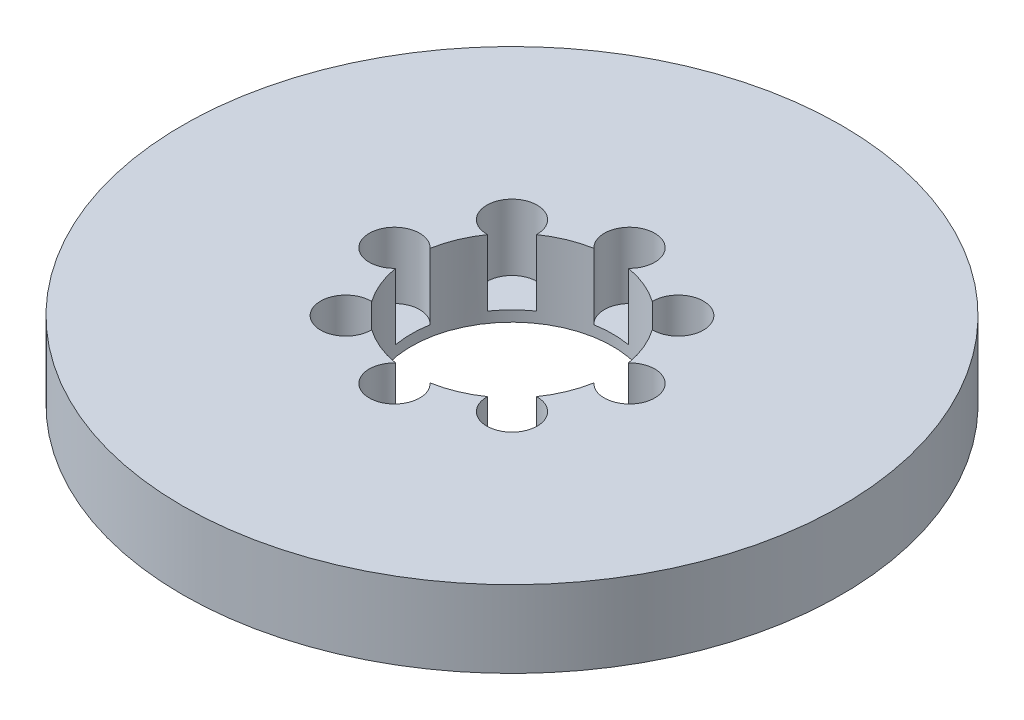
ISO-10303-21;
HEADER;
FILE_DESCRIPTION(('STEP AP214'),'2;1');
FILE_NAME('part.step','',(''),(''),'','','');
FILE_SCHEMA(('AUTOMOTIVE_DESIGN { 1 0 10303 214 1 1 1 1 }'));
ENDSEC;
DATA;
#1=APPLICATION_CONTEXT('core data for automotive mechanical design processes');
#2=APPLICATION_PROTOCOL_DEFINITION('international standard','automotive_design',2000,#1);
#3=PRODUCT_CONTEXT('',#1,'mechanical');
#4=PRODUCT('Part','Part','',(#3));
#5=PRODUCT_RELATED_PRODUCT_CATEGORY('part','',(#4));
#6=PRODUCT_DEFINITION_FORMATION('','',#4);
#7=PRODUCT_DEFINITION_CONTEXT('part definition',#1,'design');
#8=PRODUCT_DEFINITION('design','',#6,#7);
#9=PRODUCT_DEFINITION_SHAPE('','',#8);
#10=(LENGTH_UNIT() NAMED_UNIT(*) SI_UNIT(.MILLI.,.METRE.));
#11=(NAMED_UNIT(*) PLANE_ANGLE_UNIT() SI_UNIT($,.RADIAN.));
#12=(NAMED_UNIT(*) SI_UNIT($,.STERADIAN.) SOLID_ANGLE_UNIT());
#13=UNCERTAINTY_MEASURE_WITH_UNIT(LENGTH_MEASURE(1.E-05),#10,'distance_accuracy_value','');
#14=(GEOMETRIC_REPRESENTATION_CONTEXT(3) GLOBAL_UNCERTAINTY_ASSIGNED_CONTEXT((#13)) GLOBAL_UNIT_ASSIGNED_CONTEXT((#10,
#11,#12)) REPRESENTATION_CONTEXT('',''));
#15=CARTESIAN_POINT('',(0.,0.,0.));
#16=DIRECTION('',(0.,0.,1.));
#17=DIRECTION('',(1.,0.,0.));
#18=AXIS2_PLACEMENT_3D('',#15,#16,#17);
#19=CARTESIAN_POINT('',(0.,21.,0.));
#20=DIRECTION('',(0.,-1.,0.));
#21=DIRECTION('',(0.,0.,-1.));
#22=AXIS2_PLACEMENT_3D('',#19,#20,#21);
#23=CYLINDRICAL_SURFACE('',#22,90.);
#24=CARTESIAN_POINT('',(0.,21.,0.));
#25=DIRECTION('',(0.,1.,0.));
#26=DIRECTION('',(0.,0.,1.));
#27=AXIS2_PLACEMENT_3D('',#24,#25,#26);
#28=CIRCLE('',#27,90.);
#29=CARTESIAN_POINT('',(0.,21.,-90.));
#30=VERTEX_POINT('',#29);
#31=EDGE_CURVE('E195',#30,#30,#28,.T.);
#32=CARTESIAN_POINT('',(0.,0.,0.));
#33=DIRECTION('',(0.,1.,0.));
#34=DIRECTION('',(0.,0.,1.));
#35=AXIS2_PLACEMENT_3D('',#32,#33,#34);
#36=CIRCLE('',#35,90.);
#37=CARTESIAN_POINT('',(0.,0.,-90.));
#38=VERTEX_POINT('',#37);
#39=EDGE_CURVE('E179',#38,#38,#36,.T.);
#40=CARTESIAN_POINT('',(0.,21.,-90.));
#41=CARTESIAN_POINT('',(0.,20.78125,-90.));
#42=CARTESIAN_POINT('',(0.,20.5625,-90.));
#43=CARTESIAN_POINT('',(0.,20.125,-90.));
#44=CARTESIAN_POINT('',(0.,19.90625,-90.));
#45=CARTESIAN_POINT('',(0.,19.46875,-90.));
#46=CARTESIAN_POINT('',(0.,19.25,-90.));
#47=CARTESIAN_POINT('',(0.,18.8125,-90.));
#48=CARTESIAN_POINT('',(0.,18.59375,-90.));
#49=CARTESIAN_POINT('',(0.,18.15625,-90.));
#50=CARTESIAN_POINT('',(0.,17.9375,-90.));
#51=CARTESIAN_POINT('',(0.,17.5,-90.));
#52=CARTESIAN_POINT('',(0.,17.28125,-90.));
#53=CARTESIAN_POINT('',(0.,16.84375,-90.));
#54=CARTESIAN_POINT('',(0.,16.625,-90.));
#55=CARTESIAN_POINT('',(0.,16.1875,-90.));
#56=CARTESIAN_POINT('',(0.,15.96875,-90.));
#57=CARTESIAN_POINT('',(0.,15.53125,-90.));
#58=CARTESIAN_POINT('',(0.,15.3125,-90.));
#59=CARTESIAN_POINT('',(0.,14.875,-90.));
#60=CARTESIAN_POINT('',(0.,14.65625,-90.));
#61=CARTESIAN_POINT('',(0.,14.21875,-90.));
#62=CARTESIAN_POINT('',(0.,14.,-90.));
#63=CARTESIAN_POINT('',(0.,13.5625,-90.));
#64=CARTESIAN_POINT('',(0.,13.34375,-90.));
#65=CARTESIAN_POINT('',(0.,12.90625,-90.));
#66=CARTESIAN_POINT('',(0.,12.6875,-90.));
#67=CARTESIAN_POINT('',(0.,12.25,-90.));
#68=CARTESIAN_POINT('',(0.,12.03125,-90.));
#69=CARTESIAN_POINT('',(0.,11.59375,-90.));
#70=CARTESIAN_POINT('',(0.,11.375,-90.));
#71=CARTESIAN_POINT('',(0.,10.9375,-90.));
#72=CARTESIAN_POINT('',(0.,10.71875,-90.));
#73=CARTESIAN_POINT('',(0.,10.28125,-90.));
#74=CARTESIAN_POINT('',(0.,10.0625,-90.));
#75=CARTESIAN_POINT('',(0.,9.625,-90.));
#76=CARTESIAN_POINT('',(0.,9.40625,-90.));
#77=CARTESIAN_POINT('',(0.,8.96875,-90.));
#78=CARTESIAN_POINT('',(0.,8.75,-90.));
#79=CARTESIAN_POINT('',(0.,8.3125,-90.));
#80=CARTESIAN_POINT('',(0.,8.09375,-90.));
#81=CARTESIAN_POINT('',(0.,7.65625,-90.));
#82=CARTESIAN_POINT('',(0.,7.4375,-90.));
#83=CARTESIAN_POINT('',(0.,7.,-90.));
#84=CARTESIAN_POINT('',(0.,6.78125,-90.));
#85=CARTESIAN_POINT('',(0.,6.34375,-90.));
#86=CARTESIAN_POINT('',(0.,6.125,-90.));
#87=CARTESIAN_POINT('',(0.,5.6875,-90.));
#88=CARTESIAN_POINT('',(0.,5.46875,-90.));
#89=CARTESIAN_POINT('',(0.,5.03125,-90.));
#90=CARTESIAN_POINT('',(0.,4.8125,-90.));
#91=CARTESIAN_POINT('',(0.,4.375,-90.));
#92=CARTESIAN_POINT('',(0.,4.15625,-90.));
#93=CARTESIAN_POINT('',(0.,3.71875,-90.));
#94=CARTESIAN_POINT('',(0.,3.5,-90.));
#95=CARTESIAN_POINT('',(0.,3.0625,-90.));
#96=CARTESIAN_POINT('',(0.,2.84375,-90.));
#97=CARTESIAN_POINT('',(0.,2.40625,-90.));
#98=CARTESIAN_POINT('',(0.,2.1875,-90.));
#99=CARTESIAN_POINT('',(0.,1.75,-90.));
#100=CARTESIAN_POINT('',(0.,1.53125,-90.));
#101=CARTESIAN_POINT('',(0.,1.09375,-90.));
#102=CARTESIAN_POINT('',(0.,0.875000000000001,-90.));
#103=CARTESIAN_POINT('',(0.,0.4375,-90.));
#104=CARTESIAN_POINT('',(0.,0.21875,-90.));
#105=CARTESIAN_POINT('',(0.,0.,-90.));
#106=B_SPLINE_CURVE_WITH_KNOTS('',3,(#40,#41,#42,#43,#44,#45,#46,#47,#48,#49,#50,#51,#52,#53,
#54,#55,#56,#57,#58,#59,#60,#61,#62,#63,#64,#65,#66,#67,#68,#69,#70,#71,#72,#73,#74,#75,#76,#77,
#78,#79,#80,#81,#82,#83,#84,#85,#86,#87,#88,#89,#90,#91,#92,#93,#94,#95,#96,#97,#98,#99,#100,
#101,#102,#103,#104,#105),.UNSPECIFIED.,.F.,.F.,(4,2,2,2,2,2,2,2,2,2,2,2,2,2,2,2,2,2,2,2,2,2,2,
2,2,2,2,2,2,2,2,2,4),(0.,0.656250000000001,1.3125,1.96875,2.625,3.28125,3.9375,4.59375,5.25,
5.90625,6.5625,7.21875,7.875,8.53125,9.1875,9.84375,10.5,11.15625,11.8125,12.46875,13.125,
13.78125,14.4375,15.09375,15.75,16.40625,17.0625,17.71875,18.375,19.03125,19.6875,20.34375,21.),.UNSPECIFIED.);
#107=EDGE_CURVE('BSEAM39',#30,#38,#106,.T.);
#108=ORIENTED_EDGE('',*,*,#31,.F.);
#109=ORIENTED_EDGE('',*,*,#39,.T.);
#110=ORIENTED_EDGE('',*,*,#107,.T.);
#111=ORIENTED_EDGE('',*,*,#107,.F.);
#112=EDGE_LOOP('',(#108,#110,#109,#111));
#113=FACE_BOUND('',#112,.T.);
#114=ADVANCED_FACE('F39',(#113),#23,.T.);
#115=CARTESIAN_POINT('',(0.,21.,0.));
#116=DIRECTION('',(0.,1.,0.));
#117=DIRECTION('',(0.,0.,1.));
#118=AXIS2_PLACEMENT_3D('',#115,#116,#117);
#119=PLANE('',#118);
#120=CARTESIAN_POINT('',(1.12057791049175E-13,21.,32.0946269431598));
#121=DIRECTION('',(0.,1.,0.));
#122=DIRECTION('',(1.,0.,0.));
#123=AXIS2_PLACEMENT_3D('',#120,#121,#122);
#124=CIRCLE('',#123,6.88257928102318);
#125=CARTESIAN_POINT('',(-4.72574817027754,21.,27.0909081470356));
#126=VERTEX_POINT('',#125);
#127=CARTESIAN_POINT('',(4.72574817027773,21.,27.0909081470355));
#128=VERTEX_POINT('',#127);
#129=EDGE_CURVE('E176',#126,#128,#124,.T.);
#130=ORIENTED_EDGE('',*,*,#129,.F.);
#131=CARTESIAN_POINT('',(0.,21.,0.));
#132=DIRECTION('',(0.,1.,0.));
#133=DIRECTION('',(0.,0.,1.));
#134=AXIS2_PLACEMENT_3D('',#131,#132,#133);
#135=CIRCLE('',#134,27.5);
#136=CARTESIAN_POINT('',(-15.8145562818875,21.,22.497773436654));
#137=VERTEX_POINT('',#136);
#138=EDGE_CURVE('E166',#137,#126,#135,.T.);
#139=ORIENTED_EDGE('',*,*,#138,.F.);
#140=CARTESIAN_POINT('',(-22.6943283511607,21.,22.6943283511608));
#141=DIRECTION('',(0.,1.,0.));
#142=DIRECTION('',(0.707106781186549,0.,0.707106781186546));
#143=AXIS2_PLACEMENT_3D('',#140,#141,#142);
#144=CIRCLE('',#143,6.88257928102318);
#145=CARTESIAN_POINT('',(-22.4977734366539,21.,15.8145562818875));
#146=VERTEX_POINT('',#145);
#147=EDGE_CURVE('E147',#146,#137,#144,.T.);
#148=ORIENTED_EDGE('',*,*,#147,.F.);
#149=CARTESIAN_POINT('',(-27.0909081470356,21.,4.72574817027764));
#150=VERTEX_POINT('',#149);
#151=EDGE_CURVE('E180',#150,#146,#135,.T.);
#152=ORIENTED_EDGE('',*,*,#151,.F.);
#153=CARTESIAN_POINT('',(-32.0946269431598,21.,0.));
#154=DIRECTION('',(0.,1.,0.));
#155=DIRECTION('',(0.,0.,1.));
#156=AXIS2_PLACEMENT_3D('',#153,#154,#155);
#157=CIRCLE('',#156,6.88257928102318);
#158=CARTESIAN_POINT('',(-27.0909081470356,21.,-4.72574817027764));
#159=VERTEX_POINT('',#158);
#160=EDGE_CURVE('E186',#159,#150,#157,.T.);
#161=ORIENTED_EDGE('',*,*,#160,.F.);
#162=CARTESIAN_POINT('',(-22.4977734366542,21.,-15.8145562818872));
#163=VERTEX_POINT('',#162);
#164=EDGE_CURVE('E182',#163,#159,#135,.T.);
#165=ORIENTED_EDGE('',*,*,#164,.F.);
#166=CARTESIAN_POINT('',(-22.6943283511611,21.,-22.6943283511605));
#167=DIRECTION('',(0.,1.,0.));
#168=DIRECTION('',(-0.707106781186539,0.,0.707106781186556));
#169=AXIS2_PLACEMENT_3D('',#166,#167,#168);
#170=CIRCLE('',#169,6.88257928102318);
#171=CARTESIAN_POINT('',(-15.8145562818878,21.,-22.4977734366538));
#172=VERTEX_POINT('',#171);
#173=EDGE_CURVE('E446',#172,#163,#170,.T.);
#174=ORIENTED_EDGE('',*,*,#173,.F.);
#175=CARTESIAN_POINT('',(-4.72574817027792,21.,-27.0909081470355));
#176=VERTEX_POINT('',#175);
#177=EDGE_CURVE('E452',#176,#172,#135,.T.);
#178=ORIENTED_EDGE('',*,*,#177,.F.);
#179=CARTESIAN_POINT('',(-3.36173373147524E-13,21.,-32.0946269431598));
#180=DIRECTION('',(0.,1.,0.));
#181=DIRECTION('',(-1.,0.,0.));
#182=AXIS2_PLACEMENT_3D('',#179,#180,#181);
#183=CIRCLE('',#182,6.88257928102318);
#184=CARTESIAN_POINT('',(4.72574817027735,21.,-27.0909081470356));
#185=VERTEX_POINT('',#184);
#186=EDGE_CURVE('E477',#185,#176,#183,.T.);
#187=ORIENTED_EDGE('',*,*,#186,.F.);
#188=CARTESIAN_POINT('',(15.8145562818873,21.,-22.4977734366541));
#189=VERTEX_POINT('',#188);
#190=EDGE_CURVE('E460',#189,#185,#135,.T.);
#191=ORIENTED_EDGE('',*,*,#190,.F.);
#192=CARTESIAN_POINT('',(22.6943283511606,21.,-22.694328351161));
#193=DIRECTION('',(0.,1.,0.));
#194=DIRECTION('',(-0.707106781186554,0.,-0.707106781186541));
#195=AXIS2_PLACEMENT_3D('',#192,#193,#194);
#196=CIRCLE('',#195,6.88257928102318);
#197=CARTESIAN_POINT('',(22.4977734366538,21.,-15.8145562818877));
#198=VERTEX_POINT('',#197);
#199=EDGE_CURVE('E464',#198,#189,#196,.T.);
#200=ORIENTED_EDGE('',*,*,#199,.F.);
#201=CARTESIAN_POINT('',(27.0909081470356,21.,-4.72574817027764));
#202=VERTEX_POINT('',#201);
#203=EDGE_CURVE('E459',#202,#198,#135,.T.);
#204=ORIENTED_EDGE('',*,*,#203,.F.);
#205=CARTESIAN_POINT('',(32.0946269431598,21.,0.));
#206=DIRECTION('',(0.,1.,0.));
#207=DIRECTION('',(0.,0.,-1.));
#208=AXIS2_PLACEMENT_3D('',#205,#206,#207);
#209=CIRCLE('',#208,6.88257928102318);
#210=CARTESIAN_POINT('',(27.0909081470356,21.,4.72574817027764));
#211=VERTEX_POINT('',#210);
#212=EDGE_CURVE('E469',#211,#202,#209,.T.);
#213=ORIENTED_EDGE('',*,*,#212,.F.);
#214=CARTESIAN_POINT('',(22.497773436654,21.,15.8145562818874));
#215=VERTEX_POINT('',#214);
#216=EDGE_CURVE('E181',#215,#211,#135,.T.);
#217=ORIENTED_EDGE('',*,*,#216,.F.);
#218=CARTESIAN_POINT('',(22.6943283511609,21.,22.6943283511607));
#219=DIRECTION('',(0.,1.,0.));
#220=DIRECTION('',(0.707106781186544,0.,-0.707106781186551));
#221=AXIS2_PLACEMENT_3D('',#218,#219,#220);
#222=CIRCLE('',#221,6.88257928102318);
#223=CARTESIAN_POINT('',(15.8145562818876,21.,22.4977734366539));
#224=VERTEX_POINT('',#223);
#225=EDGE_CURVE('E475',#224,#215,#222,.T.);
#226=ORIENTED_EDGE('',*,*,#225,.F.);
#227=EDGE_CURVE('E177',#128,#224,#135,.T.);
#228=ORIENTED_EDGE('',*,*,#227,.F.);
#229=EDGE_LOOP('',(#130,#139,#148,#152,#161,#165,#174,#178,#187,#191,#200,#204,#213,#217,#226,#228));
#230=FACE_BOUND('',#229,.T.);
#231=ORIENTED_EDGE('',*,*,#31,.T.);
#232=EDGE_LOOP('',(#231));
#233=FACE_BOUND('',#232,.T.);
#234=ADVANCED_FACE('F172',(#230,#233),#119,.T.);
#235=CARTESIAN_POINT('',(0.,0.,0.));
#236=DIRECTION('',(0.,1.,0.));
#237=DIRECTION('',(0.,0.,1.));
#238=AXIS2_PLACEMENT_3D('',#235,#236,#237);
#239=PLANE('',#238);
#240=CARTESIAN_POINT('',(0.,0.,0.));
#241=DIRECTION('',(0.,1.,0.));
#242=DIRECTION('',(0.,0.,1.));
#243=AXIS2_PLACEMENT_3D('',#240,#241,#242);
#244=CIRCLE('',#243,27.5);
#245=CARTESIAN_POINT('',(0.,0.,27.5));
#246=VERTEX_POINT('',#245);
#247=EDGE_CURVE('E187',#246,#246,#244,.T.);
#248=ORIENTED_EDGE('',*,*,#247,.T.);
#249=EDGE_LOOP('',(#248));
#250=FACE_BOUND('',#249,.T.);
#251=ORIENTED_EDGE('',*,*,#39,.F.);
#252=EDGE_LOOP('',(#251));
#253=FACE_BOUND('',#252,.T.);
#254=ADVANCED_FACE('F270',(#250,#253),#239,.F.);
#255=CARTESIAN_POINT('',(0.,21.,0.));
#256=DIRECTION('',(0.,-1.,0.));
#257=DIRECTION('',(0.,0.,-1.));
#258=AXIS2_PLACEMENT_3D('',#255,#256,#257);
#259=CYLINDRICAL_SURFACE('',#258,27.5);
#260=DIRECTION('',(0.,1.,0.));
#261=VECTOR('',#260,1.);
#262=CARTESIAN_POINT('',(-4.72574817027753,11.9654193824633,27.0909081470356));
#263=LINE('',#262,#261);
#264=CARTESIAN_POINT('',(-4.72574817027754,2.93083876492653,27.0909081470356));
#265=VERTEX_POINT('',#264);
#266=EDGE_CURVE('E11',#265,#126,#263,.T.);
#267=ORIENTED_EDGE('',*,*,#266,.F.);
#268=CARTESIAN_POINT('',(0.,2.93083876492653,0.));
#269=DIRECTION('',(0.,1.,0.));
#270=DIRECTION('',(0.,0.,1.));
#271=AXIS2_PLACEMENT_3D('',#268,#269,#270);
#272=CIRCLE('',#271,27.5);
#273=CARTESIAN_POINT('',(4.72574817027773,2.93083876492653,27.0909081470355));
#274=VERTEX_POINT('',#273);
#275=EDGE_CURVE('E250',#265,#274,#272,.T.);
#276=ORIENTED_EDGE('',*,*,#275,.T.);
#277=DIRECTION('',(0.,1.,0.));
#278=VECTOR('',#277,1.);
#279=CARTESIAN_POINT('',(4.72574817027772,11.9654193824633,27.0909081470355));
#280=LINE('',#279,#278);
#281=EDGE_CURVE('E46',#128,#274,#280,.F.);
#282=ORIENTED_EDGE('',*,*,#281,.F.);
#283=ORIENTED_EDGE('',*,*,#227,.T.);
#284=DIRECTION('',(0.,1.,0.));
#285=VECTOR('',#284,1.);
#286=CARTESIAN_POINT('',(15.8145562818876,11.9654193824633,22.4977734366539));
#287=LINE('',#286,#285);
#288=CARTESIAN_POINT('',(15.8145562818876,2.93083876492653,22.4977734366539));
#289=VERTEX_POINT('',#288);
#290=EDGE_CURVE('E244',#289,#224,#287,.T.);
#291=ORIENTED_EDGE('',*,*,#290,.F.);
#292=CARTESIAN_POINT('',(0.,2.93083876492653,0.));
#293=DIRECTION('',(0.,1.,0.));
#294=DIRECTION('',(0.,0.,1.));
#295=AXIS2_PLACEMENT_3D('',#292,#293,#294);
#296=CIRCLE('',#295,27.5);
#297=CARTESIAN_POINT('',(22.497773436654,2.93083876492653,15.8145562818874));
#298=VERTEX_POINT('',#297);
#299=EDGE_CURVE('E238',#289,#298,#296,.T.);
#300=ORIENTED_EDGE('',*,*,#299,.T.);
#301=DIRECTION('',(0.,1.,0.));
#302=VECTOR('',#301,1.);
#303=CARTESIAN_POINT('',(22.497773436654,11.9654193824633,15.8145562818874));
#304=LINE('',#303,#302);
#305=EDGE_CURVE('E242',#215,#298,#304,.F.);
#306=ORIENTED_EDGE('',*,*,#305,.F.);
#307=ORIENTED_EDGE('',*,*,#216,.T.);
#308=DIRECTION('',(0.,1.,0.));
#309=VECTOR('',#308,1.);
#310=CARTESIAN_POINT('',(27.0909081470355,11.9654193824633,4.72574817027763));
#311=LINE('',#310,#309);
#312=CARTESIAN_POINT('',(27.0909081470356,2.93083876492653,4.72574817027764));
#313=VERTEX_POINT('',#312);
#314=EDGE_CURVE('E236',#313,#211,#311,.T.);
#315=ORIENTED_EDGE('',*,*,#314,.F.);
#316=CARTESIAN_POINT('',(0.,2.93083876492653,0.));
#317=DIRECTION('',(0.,1.,0.));
#318=DIRECTION('',(0.,0.,1.));
#319=AXIS2_PLACEMENT_3D('',#316,#317,#318);
#320=CIRCLE('',#319,27.5);
#321=CARTESIAN_POINT('',(27.0909081470356,2.93083876492653,-4.72574817027764));
#322=VERTEX_POINT('',#321);
#323=EDGE_CURVE('E235',#313,#322,#320,.T.);
#324=ORIENTED_EDGE('',*,*,#323,.T.);
#325=DIRECTION('',(0.,1.,0.));
#326=VECTOR('',#325,1.);
#327=CARTESIAN_POINT('',(27.0909081470355,11.9654193824633,-4.72574817027763));
#328=LINE('',#327,#326);
#329=EDGE_CURVE('E234',#202,#322,#328,.F.);
#330=ORIENTED_EDGE('',*,*,#329,.F.);
#331=ORIENTED_EDGE('',*,*,#203,.T.);
#332=DIRECTION('',(0.,1.,0.));
#333=VECTOR('',#332,1.);
#334=CARTESIAN_POINT('',(22.4977734366538,11.9654193824633,-15.8145562818877));
#335=LINE('',#334,#333);
#336=CARTESIAN_POINT('',(22.4977734366538,2.93083876492653,-15.8145562818877));
#337=VERTEX_POINT('',#336);
#338=EDGE_CURVE('E229',#337,#198,#335,.T.);
#339=ORIENTED_EDGE('',*,*,#338,.F.);
#340=CARTESIAN_POINT('',(0.,2.93083876492653,0.));
#341=DIRECTION('',(0.,1.,0.));
#342=DIRECTION('',(0.,0.,1.));
#343=AXIS2_PLACEMENT_3D('',#340,#341,#342);
#344=CIRCLE('',#343,27.5);
#345=CARTESIAN_POINT('',(15.8145562818873,2.93083876492653,-22.4977734366541));
#346=VERTEX_POINT('',#345);
#347=EDGE_CURVE('E221',#337,#346,#344,.T.);
#348=ORIENTED_EDGE('',*,*,#347,.T.);
#349=DIRECTION('',(0.,1.,0.));
#350=VECTOR('',#349,1.);
#351=CARTESIAN_POINT('',(15.8145562818873,11.9654193824633,-22.4977734366541));
#352=LINE('',#351,#350);
#353=EDGE_CURVE('E230',#189,#346,#352,.F.);
#354=ORIENTED_EDGE('',*,*,#353,.F.);
#355=ORIENTED_EDGE('',*,*,#190,.T.);
#356=DIRECTION('',(0.,1.,0.));
#357=VECTOR('',#356,1.);
#358=CARTESIAN_POINT('',(4.72574817027734,11.9654193824633,-27.0909081470356));
#359=LINE('',#358,#357);
#360=CARTESIAN_POINT('',(4.72574817027735,2.93083876492653,-27.0909081470356));
#361=VERTEX_POINT('',#360);
#362=EDGE_CURVE('E225',#361,#185,#359,.T.);
#363=ORIENTED_EDGE('',*,*,#362,.F.);
#364=CARTESIAN_POINT('',(0.,2.93083876492653,0.));
#365=DIRECTION('',(0.,1.,0.));
#366=DIRECTION('',(0.,0.,1.));
#367=AXIS2_PLACEMENT_3D('',#364,#365,#366);
#368=CIRCLE('',#367,27.5);
#369=CARTESIAN_POINT('',(-4.72574817027792,2.93083876492653,-27.0909081470355));
#370=VERTEX_POINT('',#369);
#371=EDGE_CURVE('E216',#361,#370,#368,.T.);
#372=ORIENTED_EDGE('',*,*,#371,.T.);
#373=DIRECTION('',(0.,1.,0.));
#374=VECTOR('',#373,1.);
#375=CARTESIAN_POINT('',(-4.72574817027791,11.9654193824633,-27.0909081470355));
#376=LINE('',#375,#374);
#377=EDGE_CURVE('E218',#176,#370,#376,.F.);
#378=ORIENTED_EDGE('',*,*,#377,.F.);
#379=ORIENTED_EDGE('',*,*,#177,.T.);
#380=DIRECTION('',(0.,1.,0.));
#381=VECTOR('',#380,1.);
#382=CARTESIAN_POINT('',(-15.8145562818878,11.9654193824633,-22.4977734366538));
#383=LINE('',#382,#381);
#384=CARTESIAN_POINT('',(-15.8145562818878,2.93083876492653,-22.4977734366538));
#385=VERTEX_POINT('',#384);
#386=EDGE_CURVE('E212',#385,#172,#383,.T.);
#387=ORIENTED_EDGE('',*,*,#386,.F.);
#388=CARTESIAN_POINT('',(0.,2.93083876492653,0.));
#389=DIRECTION('',(0.,1.,0.));
#390=DIRECTION('',(0.,0.,1.));
#391=AXIS2_PLACEMENT_3D('',#388,#389,#390);
#392=CIRCLE('',#391,27.5);
#393=CARTESIAN_POINT('',(-22.4977734366542,2.93083876492653,-15.8145562818872));
#394=VERTEX_POINT('',#393);
#395=EDGE_CURVE('E208',#385,#394,#392,.T.);
#396=ORIENTED_EDGE('',*,*,#395,.T.);
#397=DIRECTION('',(0.,1.,0.));
#398=VECTOR('',#397,1.);
#399=CARTESIAN_POINT('',(-22.4977734366541,11.9654193824633,-15.8145562818872));
#400=LINE('',#399,#398);
#401=EDGE_CURVE('E211',#163,#394,#400,.F.);
#402=ORIENTED_EDGE('',*,*,#401,.F.);
#403=ORIENTED_EDGE('',*,*,#164,.T.);
#404=DIRECTION('',(0.,1.,0.));
#405=VECTOR('',#404,1.);
#406=CARTESIAN_POINT('',(-27.0909081470355,11.9654193824633,-4.72574817027763));
#407=LINE('',#406,#405);
#408=CARTESIAN_POINT('',(-27.0909081470356,2.93083876492653,-4.72574817027764));
#409=VERTEX_POINT('',#408);
#410=EDGE_CURVE('E201',#409,#159,#407,.T.);
#411=ORIENTED_EDGE('',*,*,#410,.F.);
#412=CARTESIAN_POINT('',(0.,2.93083876492653,0.));
#413=DIRECTION('',(0.,1.,0.));
#414=DIRECTION('',(0.,0.,1.));
#415=AXIS2_PLACEMENT_3D('',#412,#413,#414);
#416=CIRCLE('',#415,27.5);
#417=CARTESIAN_POINT('',(-27.0909081470356,2.93083876492653,4.72574817027764));
#418=VERTEX_POINT('',#417);
#419=EDGE_CURVE('E194',#409,#418,#416,.T.);
#420=ORIENTED_EDGE('',*,*,#419,.T.);
#421=DIRECTION('',(0.,1.,0.));
#422=VECTOR('',#421,1.);
#423=CARTESIAN_POINT('',(-27.0909081470355,11.9654193824633,4.72574817027763));
#424=LINE('',#423,#422);
#425=EDGE_CURVE('E199',#150,#418,#424,.F.);
#426=ORIENTED_EDGE('',*,*,#425,.F.);
#427=ORIENTED_EDGE('',*,*,#151,.T.);
#428=DIRECTION('',(0.,1.,0.));
#429=VECTOR('',#428,1.);
#430=CARTESIAN_POINT('',(-22.4977734366539,11.9654193824633,15.8145562818875));
#431=LINE('',#430,#429);
#432=CARTESIAN_POINT('',(-22.4977734366539,2.93083876492653,15.8145562818875));
#433=VERTEX_POINT('',#432);
#434=EDGE_CURVE('E160',#433,#146,#431,.T.);
#435=ORIENTED_EDGE('',*,*,#434,.F.);
#436=CARTESIAN_POINT('',(0.,2.93083876492653,0.));
#437=DIRECTION('',(0.,1.,0.));
#438=DIRECTION('',(0.,0.,1.));
#439=AXIS2_PLACEMENT_3D('',#436,#437,#438);
#440=CIRCLE('',#439,27.5);
#441=CARTESIAN_POINT('',(-15.8145562818875,2.93083876492653,22.497773436654));
#442=VERTEX_POINT('',#441);
#443=EDGE_CURVE('E168',#433,#442,#440,.T.);
#444=ORIENTED_EDGE('',*,*,#443,.T.);
#445=DIRECTION('',(0.,1.,0.));
#446=VECTOR('',#445,1.);
#447=CARTESIAN_POINT('',(-15.8145562818875,11.9654193824633,22.497773436654));
#448=LINE('',#447,#446);
#449=EDGE_CURVE('E152',#137,#442,#448,.F.);
#450=ORIENTED_EDGE('',*,*,#449,.F.);
#451=ORIENTED_EDGE('',*,*,#138,.T.);
#452=EDGE_LOOP('',(#267,#276,#282,#283,#291,#300,#306,#307,#315,#324,#330,#331,#339,#348,#354,
#355,#363,#372,#378,#379,#387,#396,#402,#403,#411,#420,#426,#427,#435,#444,#450,#451));
#453=FACE_BOUND('',#452,.T.);
#454=ORIENTED_EDGE('',*,*,#247,.F.);
#455=EDGE_LOOP('',(#454));
#456=FACE_BOUND('',#455,.T.);
#457=ADVANCED_FACE('F170',(#453,#456),#259,.F.);
#458=CARTESIAN_POINT('',(-32.0946269431598,2.93083876492653,0.));
#459=DIRECTION('',(0.,1.,0.));
#460=DIRECTION('',(0.,0.,1.));
#461=AXIS2_PLACEMENT_3D('',#458,#459,#460);
#462=CYLINDRICAL_SURFACE('',#461,6.88257928102318);
#463=ORIENTED_EDGE('',*,*,#410,.T.);
#464=ORIENTED_EDGE('',*,*,#160,.T.);
#465=ORIENTED_EDGE('',*,*,#425,.T.);
#466=CARTESIAN_POINT('',(-32.0946269431598,2.93083876492653,0.));
#467=DIRECTION('',(0.,1.,0.));
#468=DIRECTION('',(0.,0.,1.));
#469=AXIS2_PLACEMENT_3D('',#466,#467,#468);
#470=CIRCLE('',#469,6.88257928102318);
#471=EDGE_CURVE('E191',#409,#418,#470,.T.);
#472=ORIENTED_EDGE('',*,*,#471,.F.);
#473=EDGE_LOOP('',(#463,#464,#465,#472));
#474=FACE_BOUND('',#473,.T.);
#475=ADVANCED_FACE('F279',(#474),#462,.F.);
#476=CARTESIAN_POINT('',(-32.0946269431598,2.93083876492653,0.));
#477=DIRECTION('',(0.,1.,0.));
#478=DIRECTION('',(0.,0.,1.));
#479=AXIS2_PLACEMENT_3D('',#476,#477,#478);
#480=PLANE('',#479);
#481=ORIENTED_EDGE('',*,*,#471,.T.);
#482=ORIENTED_EDGE('',*,*,#419,.F.);
#483=EDGE_LOOP('',(#481,#482));
#484=FACE_BOUND('',#483,.T.);
#485=ADVANCED_FACE('F285',(#484),#480,.T.);
#486=CARTESIAN_POINT('',(-22.6943283511607,2.93083876492653,22.6943283511608));
#487=DIRECTION('',(0.,1.,0.));
#488=DIRECTION('',(0.,0.,1.));
#489=AXIS2_PLACEMENT_3D('',#486,#487,#488);
#490=CYLINDRICAL_SURFACE('',#489,6.88257928102318);
#491=ORIENTED_EDGE('',*,*,#434,.T.);
#492=ORIENTED_EDGE('',*,*,#147,.T.);
#493=ORIENTED_EDGE('',*,*,#449,.T.);
#494=CARTESIAN_POINT('',(-22.6943283511607,2.93083876492653,22.6943283511608));
#495=DIRECTION('',(0.,1.,0.));
#496=DIRECTION('',(0.707106781186549,0.,0.707106781186546));
#497=AXIS2_PLACEMENT_3D('',#494,#495,#496);
#498=CIRCLE('',#497,6.88257928102318);
#499=EDGE_CURVE('E165',#433,#442,#498,.T.);
#500=ORIENTED_EDGE('',*,*,#499,.F.);
#501=EDGE_LOOP('',(#491,#492,#493,#500));
#502=FACE_BOUND('',#501,.T.);
#503=ADVANCED_FACE('F155',(#502),#490,.F.);
#504=CARTESIAN_POINT('',(-22.6943283511607,2.93083876492653,22.6943283511608));
#505=DIRECTION('',(0.,1.,0.));
#506=DIRECTION('',(0.707106781186549,0.,0.707106781186546));
#507=AXIS2_PLACEMENT_3D('',#504,#505,#506);
#508=PLANE('',#507);
#509=ORIENTED_EDGE('',*,*,#499,.T.);
#510=ORIENTED_EDGE('',*,*,#443,.F.);
#511=EDGE_LOOP('',(#509,#510));
#512=FACE_BOUND('',#511,.T.);
#513=ADVANCED_FACE('F288',(#512),#508,.T.);
#514=CARTESIAN_POINT('',(-22.6943283511611,2.93083876492653,-22.6943283511605));
#515=DIRECTION('',(0.,1.,0.));
#516=DIRECTION('',(0.,0.,1.));
#517=AXIS2_PLACEMENT_3D('',#514,#515,#516);
#518=CYLINDRICAL_SURFACE('',#517,6.88257928102318);
#519=ORIENTED_EDGE('',*,*,#386,.T.);
#520=ORIENTED_EDGE('',*,*,#173,.T.);
#521=ORIENTED_EDGE('',*,*,#401,.T.);
#522=CARTESIAN_POINT('',(-22.6943283511611,2.93083876492653,-22.6943283511605));
#523=DIRECTION('',(0.,1.,0.));
#524=DIRECTION('',(-0.707106781186539,0.,0.707106781186556));
#525=AXIS2_PLACEMENT_3D('',#522,#523,#524);
#526=CIRCLE('',#525,6.88257928102318);
#527=EDGE_CURVE('E447',#385,#394,#526,.T.);
#528=ORIENTED_EDGE('',*,*,#527,.F.);
#529=EDGE_LOOP('',(#519,#520,#521,#528));
#530=FACE_BOUND('',#529,.T.);
#531=ADVANCED_FACE('F295',(#530),#518,.F.);
#532=CARTESIAN_POINT('',(-22.6943283511611,2.93083876492653,-22.6943283511605));
#533=DIRECTION('',(0.,1.,0.));
#534=DIRECTION('',(-0.707106781186539,0.,0.707106781186556));
#535=AXIS2_PLACEMENT_3D('',#532,#533,#534);
#536=PLANE('',#535);
#537=ORIENTED_EDGE('',*,*,#527,.T.);
#538=ORIENTED_EDGE('',*,*,#395,.F.);
#539=EDGE_LOOP('',(#537,#538));
#540=FACE_BOUND('',#539,.T.);
#541=ADVANCED_FACE('F375',(#540),#536,.T.);
#542=CARTESIAN_POINT('',(-3.36173373147524E-13,2.93083876492653,-32.0946269431598));
#543=DIRECTION('',(0.,1.,0.));
#544=DIRECTION('',(0.,0.,1.));
#545=AXIS2_PLACEMENT_3D('',#542,#543,#544);
#546=CYLINDRICAL_SURFACE('',#545,6.88257928102318);
#547=ORIENTED_EDGE('',*,*,#362,.T.);
#548=ORIENTED_EDGE('',*,*,#186,.T.);
#549=ORIENTED_EDGE('',*,*,#377,.T.);
#550=CARTESIAN_POINT('',(-3.36173373147524E-13,2.93083876492653,-32.0946269431598));
#551=DIRECTION('',(0.,1.,0.));
#552=DIRECTION('',(-1.,0.,0.));
#553=AXIS2_PLACEMENT_3D('',#550,#551,#552);
#554=CIRCLE('',#553,6.88257928102318);
#555=EDGE_CURVE('E467',#361,#370,#554,.T.);
#556=ORIENTED_EDGE('',*,*,#555,.F.);
#557=EDGE_LOOP('',(#547,#548,#549,#556));
#558=FACE_BOUND('',#557,.T.);
#559=ADVANCED_FACE('F361',(#558),#546,.F.);
#560=CARTESIAN_POINT('',(-3.36173373147524E-13,2.93083876492653,-32.0946269431598));
#561=DIRECTION('',(0.,1.,0.));
#562=DIRECTION('',(-1.,0.,0.));
#563=AXIS2_PLACEMENT_3D('',#560,#561,#562);
#564=PLANE('',#563);
#565=ORIENTED_EDGE('',*,*,#555,.T.);
#566=ORIENTED_EDGE('',*,*,#371,.F.);
#567=EDGE_LOOP('',(#565,#566));
#568=FACE_BOUND('',#567,.T.);
#569=ADVANCED_FACE('F297',(#568),#564,.T.);
#570=CARTESIAN_POINT('',(22.6943283511606,2.93083876492653,-22.694328351161));
#571=DIRECTION('',(0.,1.,0.));
#572=DIRECTION('',(0.,0.,1.));
#573=AXIS2_PLACEMENT_3D('',#570,#571,#572);
#574=CYLINDRICAL_SURFACE('',#573,6.88257928102318);
#575=ORIENTED_EDGE('',*,*,#338,.T.);
#576=ORIENTED_EDGE('',*,*,#199,.T.);
#577=ORIENTED_EDGE('',*,*,#353,.T.);
#578=CARTESIAN_POINT('',(22.6943283511606,2.93083876492653,-22.694328351161));
#579=DIRECTION('',(0.,1.,0.));
#580=DIRECTION('',(-0.707106781186554,0.,-0.707106781186541));
#581=AXIS2_PLACEMENT_3D('',#578,#579,#580);
#582=CIRCLE('',#581,6.88257928102318);
#583=EDGE_CURVE('E470',#337,#346,#582,.T.);
#584=ORIENTED_EDGE('',*,*,#583,.F.);
#585=EDGE_LOOP('',(#575,#576,#577,#584));
#586=FACE_BOUND('',#585,.T.);
#587=ADVANCED_FACE('F294',(#586),#574,.F.);
#588=CARTESIAN_POINT('',(22.6943283511606,2.93083876492653,-22.694328351161));
#589=DIRECTION('',(0.,1.,0.));
#590=DIRECTION('',(-0.707106781186554,0.,-0.707106781186541));
#591=AXIS2_PLACEMENT_3D('',#588,#589,#590);
#592=PLANE('',#591);
#593=ORIENTED_EDGE('',*,*,#583,.T.);
#594=ORIENTED_EDGE('',*,*,#347,.F.);
#595=EDGE_LOOP('',(#593,#594));
#596=FACE_BOUND('',#595,.T.);
#597=ADVANCED_FACE('F300',(#596),#592,.T.);
#598=CARTESIAN_POINT('',(32.0946269431598,2.93083876492653,0.));
#599=DIRECTION('',(0.,1.,0.));
#600=DIRECTION('',(0.,0.,1.));
#601=AXIS2_PLACEMENT_3D('',#598,#599,#600);
#602=CYLINDRICAL_SURFACE('',#601,6.88257928102318);
#603=ORIENTED_EDGE('',*,*,#314,.T.);
#604=ORIENTED_EDGE('',*,*,#212,.T.);
#605=ORIENTED_EDGE('',*,*,#329,.T.);
#606=CARTESIAN_POINT('',(32.0946269431598,2.93083876492653,0.));
#607=DIRECTION('',(0.,1.,0.));
#608=DIRECTION('',(0.,0.,-1.));
#609=AXIS2_PLACEMENT_3D('',#606,#607,#608);
#610=CIRCLE('',#609,6.88257928102318);
#611=EDGE_CURVE('E472',#313,#322,#610,.T.);
#612=ORIENTED_EDGE('',*,*,#611,.F.);
#613=EDGE_LOOP('',(#603,#604,#605,#612));
#614=FACE_BOUND('',#613,.T.);
#615=ADVANCED_FACE('F305',(#614),#602,.F.);
#616=CARTESIAN_POINT('',(32.0946269431598,2.93083876492653,0.));
#617=DIRECTION('',(0.,1.,0.));
#618=DIRECTION('',(0.,0.,-1.));
#619=AXIS2_PLACEMENT_3D('',#616,#617,#618);
#620=PLANE('',#619);
#621=ORIENTED_EDGE('',*,*,#611,.T.);
#622=ORIENTED_EDGE('',*,*,#323,.F.);
#623=EDGE_LOOP('',(#621,#622));
#624=FACE_BOUND('',#623,.T.);
#625=ADVANCED_FACE('F308',(#624),#620,.T.);
#626=CARTESIAN_POINT('',(22.6943283511609,2.93083876492653,22.6943283511607));
#627=DIRECTION('',(0.,1.,0.));
#628=DIRECTION('',(0.,0.,1.));
#629=AXIS2_PLACEMENT_3D('',#626,#627,#628);
#630=CYLINDRICAL_SURFACE('',#629,6.88257928102318);
#631=ORIENTED_EDGE('',*,*,#290,.T.);
#632=ORIENTED_EDGE('',*,*,#225,.T.);
#633=ORIENTED_EDGE('',*,*,#305,.T.);
#634=CARTESIAN_POINT('',(22.6943283511609,2.93083876492653,22.6943283511607));
#635=DIRECTION('',(0.,1.,0.));
#636=DIRECTION('',(0.707106781186544,0.,-0.707106781186551));
#637=AXIS2_PLACEMENT_3D('',#634,#635,#636);
#638=CIRCLE('',#637,6.88257928102318);
#639=EDGE_CURVE('E56',#289,#298,#638,.T.);
#640=ORIENTED_EDGE('',*,*,#639,.F.);
#641=EDGE_LOOP('',(#631,#632,#633,#640));
#642=FACE_BOUND('',#641,.T.);
#643=ADVANCED_FACE('F309',(#642),#630,.F.);
#644=CARTESIAN_POINT('',(22.6943283511609,2.93083876492653,22.6943283511607));
#645=DIRECTION('',(0.,1.,0.));
#646=DIRECTION('',(0.707106781186544,0.,-0.707106781186551));
#647=AXIS2_PLACEMENT_3D('',#644,#645,#646);
#648=PLANE('',#647);
#649=ORIENTED_EDGE('',*,*,#639,.T.);
#650=ORIENTED_EDGE('',*,*,#299,.F.);
#651=EDGE_LOOP('',(#649,#650));
#652=FACE_BOUND('',#651,.T.);
#653=ADVANCED_FACE('F256',(#652),#648,.T.);
#654=CARTESIAN_POINT('',(1.12057791049175E-13,2.93083876492653,32.0946269431598));
#655=DIRECTION('',(0.,1.,0.));
#656=DIRECTION('',(0.,0.,1.));
#657=AXIS2_PLACEMENT_3D('',#654,#655,#656);
#658=CYLINDRICAL_SURFACE('',#657,6.88257928102318);
#659=ORIENTED_EDGE('',*,*,#266,.T.);
#660=ORIENTED_EDGE('',*,*,#129,.T.);
#661=ORIENTED_EDGE('',*,*,#281,.T.);
#662=CARTESIAN_POINT('',(1.12057791049175E-13,2.93083876492653,32.0946269431598));
#663=DIRECTION('',(0.,1.,0.));
#664=DIRECTION('',(1.,0.,0.));
#665=AXIS2_PLACEMENT_3D('',#662,#663,#664);
#666=CIRCLE('',#665,6.88257928102318);
#667=EDGE_CURVE('E55',#265,#274,#666,.T.);
#668=ORIENTED_EDGE('',*,*,#667,.F.);
#669=EDGE_LOOP('',(#659,#660,#661,#668));
#670=FACE_BOUND('',#669,.T.);
#671=ADVANCED_FACE('F253',(#670),#658,.F.);
#672=CARTESIAN_POINT('',(1.12057791049175E-13,2.93083876492653,32.0946269431598));
#673=DIRECTION('',(0.,1.,0.));
#674=DIRECTION('',(1.,0.,0.));
#675=AXIS2_PLACEMENT_3D('',#672,#673,#674);
#676=PLANE('',#675);
#677=ORIENTED_EDGE('',*,*,#667,.T.);
#678=ORIENTED_EDGE('',*,*,#275,.F.);
#679=EDGE_LOOP('',(#677,#678));
#680=FACE_BOUND('',#679,.T.);
#681=ADVANCED_FACE('F252',(#680),#676,.T.);
#682=CLOSED_SHELL('',(#114,#234,#254,#457,#475,#485,#503,#513,#531,#541,#559,#569,#587,#597,
#615,#625,#643,#653,#671,#681));
#683=MANIFOLD_SOLID_BREP('B2',#682);
#684=ADVANCED_BREP_SHAPE_REPRESENTATION('',(#18,#683),#14);
#685=SHAPE_DEFINITION_REPRESENTATION(#9,#684);
ENDSEC;
END-ISO-10303-21;
